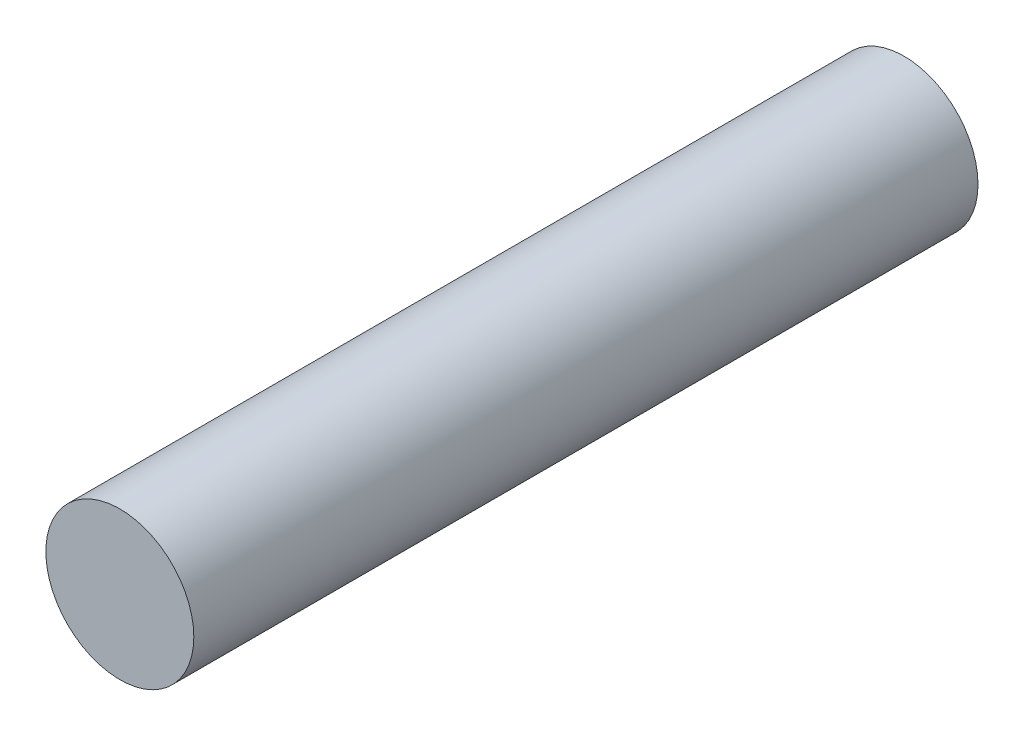
ISO-10303-21;
HEADER;
FILE_DESCRIPTION(('STEP AP214'),'2;1');
FILE_NAME('part.step','',(''),(''),'','','');
FILE_SCHEMA(('AUTOMOTIVE_DESIGN { 1 0 10303 214 1 1 1 1 }'));
ENDSEC;
DATA;
#1=APPLICATION_CONTEXT('core data for automotive mechanical design processes');
#2=APPLICATION_PROTOCOL_DEFINITION('international standard','automotive_design',2000,#1);
#3=PRODUCT_CONTEXT('',#1,'mechanical');
#4=PRODUCT('Part','Part','',(#3));
#5=PRODUCT_RELATED_PRODUCT_CATEGORY('part','',(#4));
#6=PRODUCT_DEFINITION_FORMATION('','',#4);
#7=PRODUCT_DEFINITION_CONTEXT('part definition',#1,'design');
#8=PRODUCT_DEFINITION('design','',#6,#7);
#9=PRODUCT_DEFINITION_SHAPE('','',#8);
#10=(LENGTH_UNIT() NAMED_UNIT(*) SI_UNIT(.MILLI.,.METRE.));
#11=(NAMED_UNIT(*) PLANE_ANGLE_UNIT() SI_UNIT($,.RADIAN.));
#12=(NAMED_UNIT(*) SI_UNIT($,.STERADIAN.) SOLID_ANGLE_UNIT());
#13=UNCERTAINTY_MEASURE_WITH_UNIT(LENGTH_MEASURE(1.E-05),#10,'distance_accuracy_value','');
#14=(GEOMETRIC_REPRESENTATION_CONTEXT(3) GLOBAL_UNCERTAINTY_ASSIGNED_CONTEXT((#13)) GLOBAL_UNIT_ASSIGNED_CONTEXT((#10,
#11,#12)) REPRESENTATION_CONTEXT('',''));
#15=CARTESIAN_POINT('',(0.,0.,0.));
#16=DIRECTION('',(0.,0.,1.));
#17=DIRECTION('',(1.,0.,0.));
#18=AXIS2_PLACEMENT_3D('',#15,#16,#17);
#19=CARTESIAN_POINT('',(0.,0.,-21.2));
#20=DIRECTION('',(0.,0.,1.));
#21=DIRECTION('',(1.,0.,0.));
#22=AXIS2_PLACEMENT_3D('',#19,#20,#21);
#23=CYLINDRICAL_SURFACE('',#22,2.);
#24=CARTESIAN_POINT('',(0.,0.,-21.2));
#25=DIRECTION('',(0.,0.,1.));
#26=DIRECTION('',(1.,0.,0.));
#27=AXIS2_PLACEMENT_3D('',#24,#25,#26);
#28=CIRCLE('',#27,2.);
#29=CARTESIAN_POINT('',(2.,0.,-21.2));
#30=VERTEX_POINT('',#29);
#31=EDGE_CURVE('E10',#30,#30,#28,.T.);
#32=ORIENTED_EDGE('',*,*,#31,.T.);
#33=EDGE_LOOP('',(#32));
#34=FACE_BOUND('',#33,.T.);
#35=CARTESIAN_POINT('',(0.,0.,0.));
#36=DIRECTION('',(0.,0.,1.));
#37=DIRECTION('',(1.,0.,0.));
#38=AXIS2_PLACEMENT_3D('',#35,#36,#37);
#39=CIRCLE('',#38,2.);
#40=CARTESIAN_POINT('',(2.,0.,0.));
#41=VERTEX_POINT('',#40);
#42=EDGE_CURVE('E33',#41,#41,#39,.T.);
#43=ORIENTED_EDGE('',*,*,#42,.F.);
#44=EDGE_LOOP('',(#43));
#45=FACE_BOUND('',#44,.T.);
#46=ADVANCED_FACE('F30',(#34,#45),#23,.T.);
#47=CARTESIAN_POINT('',(0.,0.,-21.2));
#48=DIRECTION('',(0.,0.,1.));
#49=DIRECTION('',(1.,0.,0.));
#50=AXIS2_PLACEMENT_3D('',#47,#48,#49);
#51=PLANE('',#50);
#52=ORIENTED_EDGE('',*,*,#31,.F.);
#53=EDGE_LOOP('',(#52));
#54=FACE_BOUND('',#53,.T.);
#55=ADVANCED_FACE('F45',(#54),#51,.F.);
#56=CARTESIAN_POINT('',(0.,0.,0.));
#57=DIRECTION('',(0.,0.,1.));
#58=DIRECTION('',(1.,0.,0.));
#59=AXIS2_PLACEMENT_3D('',#56,#57,#58);
#60=PLANE('',#59);
#61=ORIENTED_EDGE('',*,*,#42,.T.);
#62=EDGE_LOOP('',(#61));
#63=FACE_BOUND('',#62,.T.);
#64=ADVANCED_FACE('F42',(#63),#60,.T.);
#65=CLOSED_SHELL('',(#46,#55,#64));
#66=MANIFOLD_SOLID_BREP('B2',#65);
#67=ADVANCED_BREP_SHAPE_REPRESENTATION('',(#18,#66),#14);
#68=SHAPE_DEFINITION_REPRESENTATION(#9,#67);
ENDSEC;
END-ISO-10303-21;
